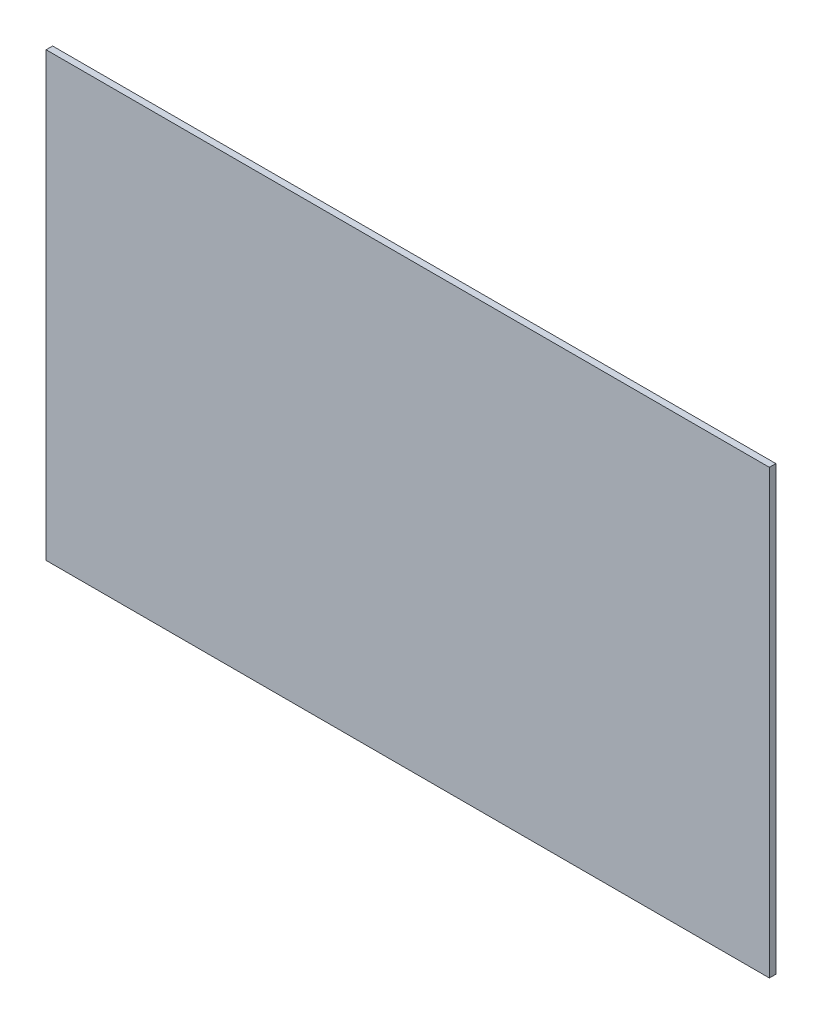
ISO-10303-21;
HEADER;
FILE_DESCRIPTION(('STEP AP214'),'2;1');
FILE_NAME('part.step','',(''),(''),'','','');
FILE_SCHEMA(('AUTOMOTIVE_DESIGN { 1 0 10303 214 1 1 1 1 }'));
ENDSEC;
DATA;
#1=APPLICATION_CONTEXT('core data for automotive mechanical design processes');
#2=APPLICATION_PROTOCOL_DEFINITION('international standard','automotive_design',2000,#1);
#3=PRODUCT_CONTEXT('',#1,'mechanical');
#4=PRODUCT('Part','Part','',(#3));
#5=PRODUCT_RELATED_PRODUCT_CATEGORY('part','',(#4));
#6=PRODUCT_DEFINITION_FORMATION('','',#4);
#7=PRODUCT_DEFINITION_CONTEXT('part definition',#1,'design');
#8=PRODUCT_DEFINITION('design','',#6,#7);
#9=PRODUCT_DEFINITION_SHAPE('','',#8);
#10=(LENGTH_UNIT() NAMED_UNIT(*) SI_UNIT(.MILLI.,.METRE.));
#11=(NAMED_UNIT(*) PLANE_ANGLE_UNIT() SI_UNIT($,.RADIAN.));
#12=(NAMED_UNIT(*) SI_UNIT($,.STERADIAN.) SOLID_ANGLE_UNIT());
#13=UNCERTAINTY_MEASURE_WITH_UNIT(LENGTH_MEASURE(1.E-05),#10,'distance_accuracy_value','');
#14=(GEOMETRIC_REPRESENTATION_CONTEXT(3) GLOBAL_UNCERTAINTY_ASSIGNED_CONTEXT((#13)) GLOBAL_UNIT_ASSIGNED_CONTEXT((#10,
#11,#12)) REPRESENTATION_CONTEXT('',''));
#15=CARTESIAN_POINT('',(0.,0.,0.));
#16=DIRECTION('',(0.,0.,1.));
#17=DIRECTION('',(1.,0.,0.));
#18=AXIS2_PLACEMENT_3D('',#15,#16,#17);
#19=CARTESIAN_POINT('',(278.,170.,-2.5));
#20=DIRECTION('',(0.,0.,-1.));
#21=DIRECTION('',(-1.,0.,0.));
#22=AXIS2_PLACEMENT_3D('',#19,#20,#21);
#23=PLANE('',#22);
#24=DIRECTION('',(-1.,0.,0.));
#25=VECTOR('',#24,1.);
#26=CARTESIAN_POINT('',(556.,340.,-2.5));
#27=LINE('',#26,#25);
#28=CARTESIAN_POINT('',(556.,340.,-2.5));
#29=VERTEX_POINT('',#28);
#30=CARTESIAN_POINT('',(0.,340.,-2.5));
#31=VERTEX_POINT('',#30);
#32=EDGE_CURVE('E68',#29,#31,#27,.T.);
#33=ORIENTED_EDGE('',*,*,#32,.F.);
#34=DIRECTION('',(0.,1.,0.));
#35=VECTOR('',#34,1.);
#36=CARTESIAN_POINT('',(556.,0.,-2.5));
#37=LINE('',#36,#35);
#38=CARTESIAN_POINT('',(556.,0.,-2.5));
#39=VERTEX_POINT('',#38);
#40=EDGE_CURVE('E55',#39,#29,#37,.T.);
#41=ORIENTED_EDGE('',*,*,#40,.F.);
#42=DIRECTION('',(1.,0.,0.));
#43=VECTOR('',#42,1.);
#44=CARTESIAN_POINT('',(0.,0.,-2.5));
#45=LINE('',#44,#43);
#46=CARTESIAN_POINT('',(0.,0.,-2.5));
#47=VERTEX_POINT('',#46);
#48=EDGE_CURVE('E20',#47,#39,#45,.T.);
#49=ORIENTED_EDGE('',*,*,#48,.F.);
#50=DIRECTION('',(0.,-1.,0.));
#51=VECTOR('',#50,1.);
#52=CARTESIAN_POINT('',(-1.04094977927525E-13,340.,-2.5));
#53=LINE('',#52,#51);
#54=EDGE_CURVE('E81',#31,#47,#53,.T.);
#55=ORIENTED_EDGE('',*,*,#54,.F.);
#56=EDGE_LOOP('',(#33,#41,#49,#55));
#57=FACE_BOUND('',#56,.T.);
#58=ADVANCED_FACE('F17',(#57),#23,.T.);
#59=CARTESIAN_POINT('',(0.,0.,0.));
#60=DIRECTION('',(0.,-1.,0.));
#61=DIRECTION('',(0.,0.,-1.));
#62=AXIS2_PLACEMENT_3D('',#59,#60,#61);
#63=PLANE('',#62);
#64=DIRECTION('',(0.,0.,1.));
#65=VECTOR('',#64,1.);
#66=CARTESIAN_POINT('',(0.,0.,0.));
#67=LINE('',#66,#65);
#68=CARTESIAN_POINT('',(0.,0.,2.5));
#69=VERTEX_POINT('',#68);
#70=EDGE_CURVE('E64',#47,#69,#67,.T.);
#71=ORIENTED_EDGE('',*,*,#70,.F.);
#72=ORIENTED_EDGE('',*,*,#48,.T.);
#73=DIRECTION('',(0.,0.,1.));
#74=VECTOR('',#73,1.);
#75=CARTESIAN_POINT('',(556.,0.,0.));
#76=LINE('',#75,#74);
#77=CARTESIAN_POINT('',(556.,0.,2.5));
#78=VERTEX_POINT('',#77);
#79=EDGE_CURVE('E61',#78,#39,#76,.F.);
#80=ORIENTED_EDGE('',*,*,#79,.F.);
#81=DIRECTION('',(1.,0.,0.));
#82=VECTOR('',#81,1.);
#83=CARTESIAN_POINT('',(278.,0.,2.5));
#84=LINE('',#83,#82);
#85=EDGE_CURVE('E83',#69,#78,#84,.T.);
#86=ORIENTED_EDGE('',*,*,#85,.F.);
#87=EDGE_LOOP('',(#71,#72,#80,#86));
#88=FACE_BOUND('',#87,.T.);
#89=ADVANCED_FACE('F60',(#88),#63,.T.);
#90=CARTESIAN_POINT('',(556.,0.,0.));
#91=DIRECTION('',(1.,0.,0.));
#92=DIRECTION('',(0.,1.,0.));
#93=AXIS2_PLACEMENT_3D('',#90,#91,#92);
#94=PLANE('',#93);
#95=ORIENTED_EDGE('',*,*,#79,.T.);
#96=ORIENTED_EDGE('',*,*,#40,.T.);
#97=DIRECTION('',(0.,0.,1.));
#98=VECTOR('',#97,1.);
#99=CARTESIAN_POINT('',(556.,340.,0.));
#100=LINE('',#99,#98);
#101=CARTESIAN_POINT('',(556.,340.,2.5));
#102=VERTEX_POINT('',#101);
#103=EDGE_CURVE('E70',#102,#29,#100,.F.);
#104=ORIENTED_EDGE('',*,*,#103,.F.);
#105=DIRECTION('',(0.,1.,0.));
#106=VECTOR('',#105,1.);
#107=CARTESIAN_POINT('',(556.,170.,2.5));
#108=LINE('',#107,#106);
#109=EDGE_CURVE('E74',#78,#102,#108,.T.);
#110=ORIENTED_EDGE('',*,*,#109,.F.);
#111=EDGE_LOOP('',(#95,#96,#104,#110));
#112=FACE_BOUND('',#111,.T.);
#113=ADVANCED_FACE('F72',(#112),#94,.T.);
#114=CARTESIAN_POINT('',(556.,340.,0.));
#115=DIRECTION('',(0.,1.,0.));
#116=DIRECTION('',(-1.,0.,0.));
#117=AXIS2_PLACEMENT_3D('',#114,#115,#116);
#118=PLANE('',#117);
#119=ORIENTED_EDGE('',*,*,#103,.T.);
#120=ORIENTED_EDGE('',*,*,#32,.T.);
#121=DIRECTION('',(0.,0.,1.));
#122=VECTOR('',#121,1.);
#123=CARTESIAN_POINT('',(-1.04094977927525E-13,340.,0.));
#124=LINE('',#123,#122);
#125=CARTESIAN_POINT('',(-1.09290471328768E-13,340.,2.5));
#126=VERTEX_POINT('',#125);
#127=EDGE_CURVE('E35',#126,#31,#124,.F.);
#128=ORIENTED_EDGE('',*,*,#127,.F.);
#129=DIRECTION('',(1.,0.,0.));
#130=VECTOR('',#129,1.);
#131=CARTESIAN_POINT('',(278.,340.,2.5));
#132=LINE('',#131,#130);
#133=EDGE_CURVE('E26',#102,#126,#132,.F.);
#134=ORIENTED_EDGE('',*,*,#133,.F.);
#135=EDGE_LOOP('',(#119,#120,#128,#134));
#136=FACE_BOUND('',#135,.T.);
#137=ADVANCED_FACE('F89',(#136),#118,.T.);
#138=CARTESIAN_POINT('',(-1.04094977927525E-13,340.,0.));
#139=DIRECTION('',(-1.,0.,0.));
#140=DIRECTION('',(0.,-1.,0.));
#141=AXIS2_PLACEMENT_3D('',#138,#139,#140);
#142=PLANE('',#141);
#143=ORIENTED_EDGE('',*,*,#127,.T.);
#144=ORIENTED_EDGE('',*,*,#54,.T.);
#145=ORIENTED_EDGE('',*,*,#70,.T.);
#146=DIRECTION('',(0.,1.,0.));
#147=VECTOR('',#146,1.);
#148=CARTESIAN_POINT('',(-1.11022302462516E-13,170.,2.5));
#149=LINE('',#148,#147);
#150=EDGE_CURVE('E11',#126,#69,#149,.F.);
#151=ORIENTED_EDGE('',*,*,#150,.F.);
#152=EDGE_LOOP('',(#143,#144,#145,#151));
#153=FACE_BOUND('',#152,.T.);
#154=ADVANCED_FACE('F91',(#153),#142,.T.);
#155=CARTESIAN_POINT('',(278.,170.,2.5));
#156=DIRECTION('',(0.,0.,1.));
#157=DIRECTION('',(1.,0.,0.));
#158=AXIS2_PLACEMENT_3D('',#155,#156,#157);
#159=PLANE('',#158);
#160=ORIENTED_EDGE('',*,*,#133,.T.);
#161=ORIENTED_EDGE('',*,*,#150,.T.);
#162=ORIENTED_EDGE('',*,*,#85,.T.);
#163=ORIENTED_EDGE('',*,*,#109,.T.);
#164=EDGE_LOOP('',(#160,#161,#162,#163));
#165=FACE_BOUND('',#164,.T.);
#166=ADVANCED_FACE('F88',(#165),#159,.T.);
#167=CLOSED_SHELL('',(#58,#89,#113,#137,#154,#166));
#168=MANIFOLD_SOLID_BREP('B1',#167);
#169=ADVANCED_BREP_SHAPE_REPRESENTATION('',(#18,#168),#14);
#170=SHAPE_DEFINITION_REPRESENTATION(#9,#169);
ENDSEC;
END-ISO-10303-21;
